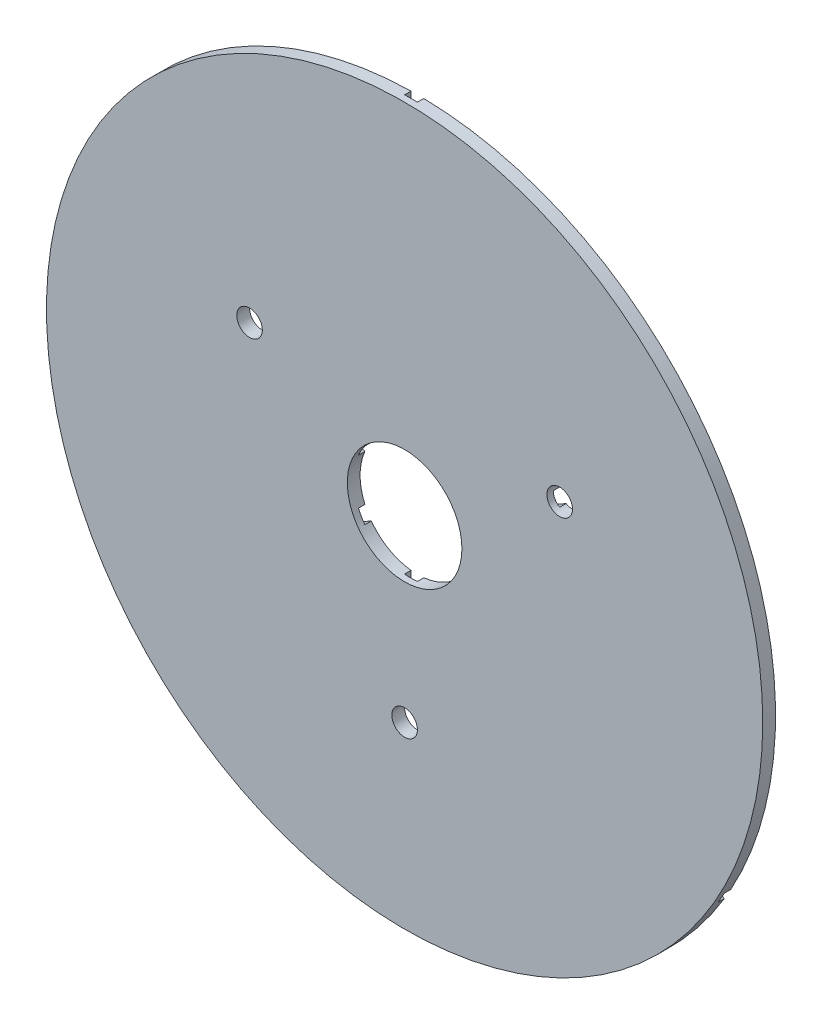
ISO-10303-21;
HEADER;
FILE_DESCRIPTION(('STEP AP214'),'2;1');
FILE_NAME('part.step','',(''),(''),'','','');
FILE_SCHEMA(('AUTOMOTIVE_DESIGN { 1 0 10303 214 1 1 1 1 }'));
ENDSEC;
DATA;
#1=APPLICATION_CONTEXT('core data for automotive mechanical design processes');
#2=APPLICATION_PROTOCOL_DEFINITION('international standard','automotive_design',2000,#1);
#3=PRODUCT_CONTEXT('',#1,'mechanical');
#4=PRODUCT('Part','Part','',(#3));
#5=PRODUCT_RELATED_PRODUCT_CATEGORY('part','',(#4));
#6=PRODUCT_DEFINITION_FORMATION('','',#4);
#7=PRODUCT_DEFINITION_CONTEXT('part definition',#1,'design');
#8=PRODUCT_DEFINITION('design','',#6,#7);
#9=PRODUCT_DEFINITION_SHAPE('','',#8);
#10=(LENGTH_UNIT() NAMED_UNIT(*) SI_UNIT(.MILLI.,.METRE.));
#11=(NAMED_UNIT(*) PLANE_ANGLE_UNIT() SI_UNIT($,.RADIAN.));
#12=(NAMED_UNIT(*) SI_UNIT($,.STERADIAN.) SOLID_ANGLE_UNIT());
#13=UNCERTAINTY_MEASURE_WITH_UNIT(LENGTH_MEASURE(1.E-05),#10,'distance_accuracy_value','');
#14=(GEOMETRIC_REPRESENTATION_CONTEXT(3) GLOBAL_UNCERTAINTY_ASSIGNED_CONTEXT((#13)) GLOBAL_UNIT_ASSIGNED_CONTEXT((#10,
#11,#12)) REPRESENTATION_CONTEXT('',''));
#15=CARTESIAN_POINT('',(0.,0.,0.));
#16=DIRECTION('',(0.,0.,1.));
#17=DIRECTION('',(1.,0.,0.));
#18=AXIS2_PLACEMENT_3D('',#15,#16,#17);
#19=CARTESIAN_POINT('',(0.,0.,1.5875));
#20=DIRECTION('',(0.,0.,-1.));
#21=DIRECTION('',(-1.,0.,0.));
#22=AXIS2_PLACEMENT_3D('',#19,#20,#21);
#23=PLANE('',#22);
#24=CARTESIAN_POINT('',(0.,0.,1.5875));
#25=DIRECTION('',(0.,0.,-1.));
#26=DIRECTION('',(-1.,0.,0.));
#27=AXIS2_PLACEMENT_3D('',#24,#25,#26);
#28=CIRCLE('',#27,14.224);
#29=CARTESIAN_POINT('',(-13.0351353306108,5.692751787375,1.5875));
#30=VERTEX_POINT('',#29);
#31=CARTESIAN_POINT('',(-11.4476353306107,8.44238244439053,1.5875));
#32=VERTEX_POINT('',#31);
#33=EDGE_CURVE('E11',#30,#32,#28,.T.);
#34=ORIENTED_EDGE('',*,*,#33,.F.);
#35=DIRECTION('',(-0.866025403784436,0.500000000000005,0.));
#36=VECTOR('',#35,1.);
#37=CARTESIAN_POINT('',(-0.793749999999747,-1.37481532850734,1.5875));
#38=LINE('',#37,#36);
#39=CARTESIAN_POINT('',(-36.9073291982175,19.4753693429848,1.5875));
#40=VERTEX_POINT('',#39);
#41=EDGE_CURVE('E140',#30,#40,#38,.T.);
#42=ORIENTED_EDGE('',*,*,#41,.T.);
#43=CARTESIAN_POINT('',(-38.4948291982183,22.225,1.5875));
#44=DIRECTION('',(0.,0.,-1.));
#45=DIRECTION('',(-1.,0.,0.));
#46=AXIS2_PLACEMENT_3D('',#43,#44,#45);
#47=CIRCLE('',#46,3.175);
#48=CARTESIAN_POINT('',(-35.3198291982183,22.2250000000009,1.5875));
#49=VERTEX_POINT('',#48);
#50=EDGE_CURVE('E58',#49,#40,#47,.T.);
#51=ORIENTED_EDGE('',*,*,#50,.F.);
#52=DIRECTION('',(-0.866025403784436,0.500000000000005,0.));
#53=VECTOR('',#52,1.);
#54=CARTESIAN_POINT('',(0.793750000000271,1.37481532850825,1.5875));
#55=LINE('',#54,#53);
#56=EDGE_CURVE('E179',#32,#49,#55,.T.);
#57=ORIENTED_EDGE('',*,*,#56,.F.);
#58=EDGE_LOOP('',(#34,#42,#51,#57));
#59=FACE_BOUND('',#58,.T.);
#60=ADVANCED_FACE('F33',(#59),#23,.T.);
#61=CARTESIAN_POINT('',(-1.5875,14.1351342317645,1.5875));
#62=VERTEX_POINT('',#61);
#63=CARTESIAN_POINT('',(1.5875,14.1351342317645,1.5875));
#64=VERTEX_POINT('',#63);
#65=EDGE_CURVE('E42',#62,#64,#28,.T.);
#66=ORIENTED_EDGE('',*,*,#65,.F.);
#67=DIRECTION('',(0.,1.,0.));
#68=VECTOR('',#67,1.);
#69=CARTESIAN_POINT('',(-1.5875,0.,1.5875));
#70=LINE('',#69,#68);
#71=CARTESIAN_POINT('',(-1.5875,88.8858247627258,1.5875));
#72=VERTEX_POINT('',#71);
#73=EDGE_CURVE('E95',#62,#72,#70,.T.);
#74=ORIENTED_EDGE('',*,*,#73,.T.);
#75=CARTESIAN_POINT('',(0.,0.,1.5875));
#76=DIRECTION('',(0.,0.,-1.));
#77=DIRECTION('',(-1.,0.,0.));
#78=AXIS2_PLACEMENT_3D('',#75,#76,#77);
#79=CIRCLE('',#78,88.9);
#80=CARTESIAN_POINT('',(1.5875,88.8858247627258,1.5875));
#81=VERTEX_POINT('',#80);
#82=EDGE_CURVE('E295',#72,#81,#79,.T.);
#83=ORIENTED_EDGE('',*,*,#82,.T.);
#84=DIRECTION('',(0.,1.,0.));
#85=VECTOR('',#84,1.);
#86=CARTESIAN_POINT('',(1.5875,0.,1.5875));
#87=LINE('',#86,#85);
#88=EDGE_CURVE('E300',#64,#81,#87,.T.);
#89=ORIENTED_EDGE('',*,*,#88,.F.);
#90=EDGE_LOOP('',(#66,#74,#83,#89));
#91=FACE_BOUND('',#90,.T.);
#92=ADVANCED_FACE('F448',(#91),#23,.T.);
#93=CARTESIAN_POINT('',(11.4476353306107,8.44238244439054,1.5875));
#94=VERTEX_POINT('',#93);
#95=CARTESIAN_POINT('',(13.0351353306108,5.69275178737501,1.5875));
#96=VERTEX_POINT('',#95);
#97=EDGE_CURVE('E478',#94,#96,#28,.T.);
#98=ORIENTED_EDGE('',*,*,#97,.F.);
#99=DIRECTION('',(0.866025403784436,0.500000000000005,0.));
#100=VECTOR('',#99,1.);
#101=CARTESIAN_POINT('',(-0.793750000000274,1.37481532850825,1.5875));
#102=LINE('',#101,#100);
#103=CARTESIAN_POINT('',(35.3198291982183,22.2250000000009,1.5875));
#104=VERTEX_POINT('',#103);
#105=EDGE_CURVE('E302',#94,#104,#102,.T.);
#106=ORIENTED_EDGE('',*,*,#105,.T.);
#107=CARTESIAN_POINT('',(38.4948291982183,22.225,1.5875));
#108=DIRECTION('',(0.,0.,-1.));
#109=DIRECTION('',(-1.,0.,0.));
#110=AXIS2_PLACEMENT_3D('',#107,#108,#109);
#111=CIRCLE('',#110,3.175);
#112=CARTESIAN_POINT('',(36.9073291982175,19.4753693429848,1.5875));
#113=VERTEX_POINT('',#112);
#114=EDGE_CURVE('E305',#113,#104,#111,.T.);
#115=ORIENTED_EDGE('',*,*,#114,.F.);
#116=DIRECTION('',(0.866025403784436,0.500000000000005,0.));
#117=VECTOR('',#116,1.);
#118=CARTESIAN_POINT('',(0.793749999999744,-1.37481532850733,1.5875));
#119=LINE('',#118,#117);
#120=EDGE_CURVE('E307',#96,#113,#119,.T.);
#121=ORIENTED_EDGE('',*,*,#120,.F.);
#122=EDGE_LOOP('',(#98,#106,#115,#121));
#123=FACE_BOUND('',#122,.T.);
#124=ADVANCED_FACE('F453',(#123),#23,.T.);
#125=CARTESIAN_POINT('',(13.0351353306113,-5.69275178737403,1.5875));
#126=VERTEX_POINT('',#125);
#127=CARTESIAN_POINT('',(11.4476353306113,-8.44238244438968,1.5875));
#128=VERTEX_POINT('',#127);
#129=EDGE_CURVE('E476',#126,#128,#28,.T.);
#130=ORIENTED_EDGE('',*,*,#129,.F.);
#131=DIRECTION('',(-0.866025403784436,0.500000000000005,0.));
#132=VECTOR('',#131,1.);
#133=CARTESIAN_POINT('',(0.793750000000271,1.37481532850825,1.5875));
#134=LINE('',#133,#132);
#135=CARTESIAN_POINT('',(77.7711322808525,-43.0680970528551,1.5875));
#136=VERTEX_POINT('',#135);
#137=EDGE_CURVE('E310',#136,#126,#134,.T.);
#138=ORIENTED_EDGE('',*,*,#137,.F.);
#139=CARTESIAN_POINT('',(0.,0.,1.5875));
#140=DIRECTION('',(0.,0.,-1.));
#141=DIRECTION('',(-1.,0.,0.));
#142=AXIS2_PLACEMENT_3D('',#139,#140,#141);
#143=CIRCLE('',#142,88.9);
#144=CARTESIAN_POINT('',(76.1836322808525,-45.8177277098707,1.5875));
#145=VERTEX_POINT('',#144);
#146=EDGE_CURVE('E313',#136,#145,#143,.T.);
#147=ORIENTED_EDGE('',*,*,#146,.T.);
#148=DIRECTION('',(-0.866025403784436,0.500000000000005,0.));
#149=VECTOR('',#148,1.);
#150=CARTESIAN_POINT('',(-0.793749999999747,-1.37481532850734,1.5875));
#151=LINE('',#150,#149);
#152=EDGE_CURVE('E316',#145,#128,#151,.T.);
#153=ORIENTED_EDGE('',*,*,#152,.T.);
#154=EDGE_LOOP('',(#130,#138,#147,#153));
#155=FACE_BOUND('',#154,.T.);
#156=ADVANCED_FACE('F462',(#155),#23,.T.);
#157=CARTESIAN_POINT('',(1.5875,-14.1351342317645,1.5875));
#158=VERTEX_POINT('',#157);
#159=CARTESIAN_POINT('',(-1.5875,-14.1351342317645,1.5875));
#160=VERTEX_POINT('',#159);
#161=EDGE_CURVE('E330',#158,#160,#28,.T.);
#162=ORIENTED_EDGE('',*,*,#161,.F.);
#163=DIRECTION('',(0.,1.,0.));
#164=VECTOR('',#163,1.);
#165=CARTESIAN_POINT('',(1.5875,0.,1.5875));
#166=LINE('',#165,#164);
#167=CARTESIAN_POINT('',(1.5875,-41.7003693429844,1.5875));
#168=VERTEX_POINT('',#167);
#169=EDGE_CURVE('E319',#168,#158,#166,.T.);
#170=ORIENTED_EDGE('',*,*,#169,.F.);
#171=CARTESIAN_POINT('',(0.,-44.45,1.5875));
#172=DIRECTION('',(0.,0.,-1.));
#173=DIRECTION('',(-1.,0.,0.));
#174=AXIS2_PLACEMENT_3D('',#171,#172,#173);
#175=CIRCLE('',#174,3.175);
#176=CARTESIAN_POINT('',(-1.5875,-41.7003693429844,1.5875));
#177=VERTEX_POINT('',#176);
#178=EDGE_CURVE('E322',#177,#168,#175,.T.);
#179=ORIENTED_EDGE('',*,*,#178,.F.);
#180=DIRECTION('',(0.,1.,0.));
#181=VECTOR('',#180,1.);
#182=CARTESIAN_POINT('',(-1.5875,0.,1.5875));
#183=LINE('',#182,#181);
#184=EDGE_CURVE('E134',#177,#160,#183,.T.);
#185=ORIENTED_EDGE('',*,*,#184,.T.);
#186=EDGE_LOOP('',(#162,#170,#179,#185));
#187=FACE_BOUND('',#186,.T.);
#188=ADVANCED_FACE('F328',(#187),#23,.T.);
#189=CARTESIAN_POINT('',(0.,0.,3.175));
#190=DIRECTION('',(0.,0.,-1.));
#191=DIRECTION('',(-1.,0.,0.));
#192=AXIS2_PLACEMENT_3D('',#189,#190,#191);
#193=CYLINDRICAL_SURFACE('',#192,88.9);
#194=CARTESIAN_POINT('',(0.,0.,3.175));
#195=DIRECTION('',(0.,0.,1.));
#196=DIRECTION('',(1.,0.,0.));
#197=AXIS2_PLACEMENT_3D('',#194,#195,#196);
#198=CIRCLE('',#197,88.9);
#199=CARTESIAN_POINT('',(88.9,0.,3.175));
#200=VERTEX_POINT('',#199);
#201=EDGE_CURVE('E208',#200,#200,#198,.T.);
#202=ORIENTED_EDGE('',*,*,#201,.F.);
#203=EDGE_LOOP('',(#202));
#204=FACE_BOUND('',#203,.T.);
#205=DIRECTION('',(0.,0.,-1.));
#206=VECTOR('',#205,1.);
#207=CARTESIAN_POINT('',(1.5875,88.8858247627258,1.5875));
#208=LINE('',#207,#206);
#209=CARTESIAN_POINT('',(1.5875,88.8858247627258,0.));
#210=VERTEX_POINT('',#209);
#211=EDGE_CURVE('E203',#81,#210,#208,.T.);
#212=ORIENTED_EDGE('',*,*,#211,.F.);
#213=ORIENTED_EDGE('',*,*,#82,.F.);
#214=DIRECTION('',(0.,0.,-1.));
#215=VECTOR('',#214,1.);
#216=CARTESIAN_POINT('',(-1.5875,88.8858247627258,1.5875));
#217=LINE('',#216,#215);
#218=CARTESIAN_POINT('',(-1.5875,88.8858247627258,0.));
#219=VERTEX_POINT('',#218);
#220=EDGE_CURVE('E146',#72,#219,#217,.T.);
#221=ORIENTED_EDGE('',*,*,#220,.T.);
#222=CARTESIAN_POINT('',(0.,0.,0.));
#223=DIRECTION('',(0.,0.,1.));
#224=DIRECTION('',(1.,0.,0.));
#225=AXIS2_PLACEMENT_3D('',#222,#223,#224);
#226=CIRCLE('',#225,88.9);
#227=CARTESIAN_POINT('',(-77.7711322808525,-43.0680970528551,0.));
#228=VERTEX_POINT('',#227);
#229=EDGE_CURVE('E210',#219,#228,#226,.T.);
#230=ORIENTED_EDGE('',*,*,#229,.T.);
#231=DIRECTION('',(0.,0.,-1.));
#232=VECTOR('',#231,1.);
#233=CARTESIAN_POINT('',(-77.7711322808525,-43.0680970528551,1.5875));
#234=LINE('',#233,#232);
#235=CARTESIAN_POINT('',(-77.7711322808525,-43.0680970528551,1.5875));
#236=VERTEX_POINT('',#235);
#237=EDGE_CURVE('E86',#236,#228,#234,.T.);
#238=ORIENTED_EDGE('',*,*,#237,.F.);
#239=CARTESIAN_POINT('',(0.,0.,1.5875));
#240=DIRECTION('',(0.,0.,-1.));
#241=DIRECTION('',(-1.,0.,0.));
#242=AXIS2_PLACEMENT_3D('',#239,#240,#241);
#243=CIRCLE('',#242,88.9);
#244=CARTESIAN_POINT('',(-76.1836322808525,-45.8177277098707,1.5875));
#245=VERTEX_POINT('',#244);
#246=EDGE_CURVE('E133',#245,#236,#243,.T.);
#247=ORIENTED_EDGE('',*,*,#246,.F.);
#248=DIRECTION('',(0.,0.,-1.));
#249=VECTOR('',#248,1.);
#250=CARTESIAN_POINT('',(-76.1836322808525,-45.8177277098707,1.5875));
#251=LINE('',#250,#249);
#252=CARTESIAN_POINT('',(-76.1836322808525,-45.8177277098707,0.));
#253=VERTEX_POINT('',#252);
#254=EDGE_CURVE('E117',#245,#253,#251,.T.);
#255=ORIENTED_EDGE('',*,*,#254,.T.);
#256=CARTESIAN_POINT('',(76.1836322808525,-45.8177277098707,0.));
#257=VERTEX_POINT('',#256);
#258=EDGE_CURVE('E212',#253,#257,#226,.T.);
#259=ORIENTED_EDGE('',*,*,#258,.T.);
#260=DIRECTION('',(0.,0.,-1.));
#261=VECTOR('',#260,1.);
#262=CARTESIAN_POINT('',(76.1836322808525,-45.8177277098707,1.5875));
#263=LINE('',#262,#261);
#264=EDGE_CURVE('E192',#145,#257,#263,.T.);
#265=ORIENTED_EDGE('',*,*,#264,.F.);
#266=ORIENTED_EDGE('',*,*,#146,.F.);
#267=DIRECTION('',(0.,0.,-1.));
#268=VECTOR('',#267,1.);
#269=CARTESIAN_POINT('',(77.7711322808525,-43.0680970528551,1.5875));
#270=LINE('',#269,#268);
#271=CARTESIAN_POINT('',(77.7711322808525,-43.0680970528551,0.));
#272=VERTEX_POINT('',#271);
#273=EDGE_CURVE('E194',#136,#272,#270,.T.);
#274=ORIENTED_EDGE('',*,*,#273,.T.);
#275=EDGE_CURVE('E183',#272,#210,#226,.T.);
#276=ORIENTED_EDGE('',*,*,#275,.T.);
#277=EDGE_LOOP('',(#212,#213,#221,#230,#238,#247,#255,#259,#265,#266,#274,#276));
#278=FACE_BOUND('',#277,.T.);
#279=ADVANCED_FACE('F35',(#204,#278),#193,.T.);
#280=CARTESIAN_POINT('',(0.,0.,0.));
#281=DIRECTION('',(0.,0.,1.));
#282=DIRECTION('',(1.,0.,0.));
#283=AXIS2_PLACEMENT_3D('',#280,#281,#282);
#284=PLANE('',#283);
#285=DIRECTION('',(0.,1.,0.));
#286=VECTOR('',#285,1.);
#287=CARTESIAN_POINT('',(-1.5875,0.,0.));
#288=LINE('',#287,#286);
#289=CARTESIAN_POINT('',(-1.5875,-41.7003693429844,0.));
#290=VERTEX_POINT('',#289);
#291=CARTESIAN_POINT('',(-1.5875,-14.1351342317645,0.));
#292=VERTEX_POINT('',#291);
#293=EDGE_CURVE('E170',#290,#292,#288,.T.);
#294=ORIENTED_EDGE('',*,*,#293,.F.);
#295=CARTESIAN_POINT('',(0.,-44.45,0.));
#296=DIRECTION('',(0.,0.,-1.));
#297=DIRECTION('',(-1.,0.,0.));
#298=AXIS2_PLACEMENT_3D('',#295,#296,#297);
#299=CIRCLE('',#298,3.175);
#300=CARTESIAN_POINT('',(1.5875,-41.7003693429844,0.));
#301=VERTEX_POINT('',#300);
#302=EDGE_CURVE('E387',#301,#290,#299,.T.);
#303=ORIENTED_EDGE('',*,*,#302,.F.);
#304=DIRECTION('',(0.,1.,0.));
#305=VECTOR('',#304,1.);
#306=CARTESIAN_POINT('',(1.5875,0.,0.));
#307=LINE('',#306,#305);
#308=CARTESIAN_POINT('',(1.5875,-14.1351342317645,0.));
#309=VERTEX_POINT('',#308);
#310=EDGE_CURVE('E167',#301,#309,#307,.T.);
#311=ORIENTED_EDGE('',*,*,#310,.T.);
#312=CARTESIAN_POINT('',(0.,0.,0.));
#313=DIRECTION('',(0.,0.,1.));
#314=DIRECTION('',(1.,0.,0.));
#315=AXIS2_PLACEMENT_3D('',#312,#313,#314);
#316=CIRCLE('',#315,14.224);
#317=CARTESIAN_POINT('',(11.4476353306113,-8.44238244438968,0.));
#318=VERTEX_POINT('',#317);
#319=EDGE_CURVE('E394',#309,#318,#316,.T.);
#320=ORIENTED_EDGE('',*,*,#319,.T.);
#321=DIRECTION('',(-0.866025403784436,0.500000000000005,0.));
#322=VECTOR('',#321,1.);
#323=CARTESIAN_POINT('',(-0.793749999999747,-1.37481532850734,0.));
#324=LINE('',#323,#322);
#325=EDGE_CURVE('E164',#257,#318,#324,.T.);
#326=ORIENTED_EDGE('',*,*,#325,.F.);
#327=ORIENTED_EDGE('',*,*,#258,.F.);
#328=DIRECTION('',(0.866025403784436,0.500000000000005,0.));
#329=VECTOR('',#328,1.);
#330=CARTESIAN_POINT('',(0.793749999999744,-1.37481532850733,0.));
#331=LINE('',#330,#329);
#332=CARTESIAN_POINT('',(-11.4476353306113,-8.44238244438967,0.));
#333=VERTEX_POINT('',#332);
#334=EDGE_CURVE('E122',#253,#333,#331,.T.);
#335=ORIENTED_EDGE('',*,*,#334,.T.);
#336=EDGE_CURVE('E504',#333,#292,#316,.T.);
#337=ORIENTED_EDGE('',*,*,#336,.T.);
#338=EDGE_LOOP('',(#294,#303,#311,#320,#326,#327,#335,#337));
#339=FACE_BOUND('',#338,.T.);
#340=ADVANCED_FACE('F467',(#339),#284,.F.);
#341=DIRECTION('',(0.866025403784436,0.500000000000005,0.));
#342=VECTOR('',#341,1.);
#343=CARTESIAN_POINT('',(0.793749999999744,-1.37481532850733,0.));
#344=LINE('',#343,#342);
#345=CARTESIAN_POINT('',(13.0351353306108,5.69275178737501,0.));
#346=VERTEX_POINT('',#345);
#347=CARTESIAN_POINT('',(36.9073291982175,19.4753693429848,0.));
#348=VERTEX_POINT('',#347);
#349=EDGE_CURVE('E158',#346,#348,#344,.T.);
#350=ORIENTED_EDGE('',*,*,#349,.T.);
#351=CARTESIAN_POINT('',(38.4948291982183,22.225,0.));
#352=DIRECTION('',(0.,0.,-1.));
#353=DIRECTION('',(-1.,0.,0.));
#354=AXIS2_PLACEMENT_3D('',#351,#352,#353);
#355=CIRCLE('',#354,3.175);
#356=CARTESIAN_POINT('',(35.3198291982183,22.225,0.));
#357=VERTEX_POINT('',#356);
#358=EDGE_CURVE('E384',#357,#348,#355,.T.);
#359=ORIENTED_EDGE('',*,*,#358,.F.);
#360=DIRECTION('',(0.866025403784436,0.500000000000005,0.));
#361=VECTOR('',#360,1.);
#362=CARTESIAN_POINT('',(-0.793750000000274,1.37481532850825,0.));
#363=LINE('',#362,#361);
#364=CARTESIAN_POINT('',(11.4476353306107,8.44238244439053,0.));
#365=VERTEX_POINT('',#364);
#366=EDGE_CURVE('E155',#365,#357,#363,.T.);
#367=ORIENTED_EDGE('',*,*,#366,.F.);
#368=CARTESIAN_POINT('',(1.5875,14.1351342317645,0.));
#369=VERTEX_POINT('',#368);
#370=EDGE_CURVE('E364',#365,#369,#316,.T.);
#371=ORIENTED_EDGE('',*,*,#370,.T.);
#372=DIRECTION('',(0.,1.,0.));
#373=VECTOR('',#372,1.);
#374=CARTESIAN_POINT('',(1.5875,0.,0.));
#375=LINE('',#374,#373);
#376=EDGE_CURVE('E153',#369,#210,#375,.T.);
#377=ORIENTED_EDGE('',*,*,#376,.T.);
#378=ORIENTED_EDGE('',*,*,#275,.F.);
#379=DIRECTION('',(-0.866025403784436,0.500000000000005,0.));
#380=VECTOR('',#379,1.);
#381=CARTESIAN_POINT('',(0.793750000000271,1.37481532850825,0.));
#382=LINE('',#381,#380);
#383=CARTESIAN_POINT('',(13.0351353306113,-5.69275178737403,0.));
#384=VERTEX_POINT('',#383);
#385=EDGE_CURVE('E161',#272,#384,#382,.T.);
#386=ORIENTED_EDGE('',*,*,#385,.T.);
#387=EDGE_CURVE('E391',#384,#346,#316,.T.);
#388=ORIENTED_EDGE('',*,*,#387,.T.);
#389=EDGE_LOOP('',(#350,#359,#367,#371,#377,#378,#386,#388));
#390=FACE_BOUND('',#389,.T.);
#391=ADVANCED_FACE('F419',(#390),#284,.F.);
#392=CARTESIAN_POINT('',(0.,0.,3.175));
#393=DIRECTION('',(0.,0.,1.));
#394=DIRECTION('',(1.,0.,0.));
#395=AXIS2_PLACEMENT_3D('',#392,#393,#394);
#396=PLANE('',#395);
#397=CARTESIAN_POINT('',(38.4948291982183,22.225,3.175));
#398=DIRECTION('',(0.,0.,-1.));
#399=DIRECTION('',(-1.,0.,0.));
#400=AXIS2_PLACEMENT_3D('',#397,#398,#399);
#401=CIRCLE('',#400,3.175);
#402=CARTESIAN_POINT('',(35.3198291982183,22.225,3.175));
#403=VERTEX_POINT('',#402);
#404=EDGE_CURVE('E398',#403,#403,#401,.T.);
#405=ORIENTED_EDGE('',*,*,#404,.T.);
#406=EDGE_LOOP('',(#405));
#407=FACE_BOUND('',#406,.T.);
#408=CARTESIAN_POINT('',(-38.4948291982183,22.225,3.175));
#409=DIRECTION('',(0.,0.,-1.));
#410=DIRECTION('',(-1.,0.,0.));
#411=AXIS2_PLACEMENT_3D('',#408,#409,#410);
#412=CIRCLE('',#411,3.175);
#413=CARTESIAN_POINT('',(-41.6698291982183,22.225,3.175));
#414=VERTEX_POINT('',#413);
#415=EDGE_CURVE('E380',#414,#414,#412,.T.);
#416=ORIENTED_EDGE('',*,*,#415,.T.);
#417=EDGE_LOOP('',(#416));
#418=FACE_BOUND('',#417,.T.);
#419=CARTESIAN_POINT('',(0.,-44.45,3.175));
#420=DIRECTION('',(0.,0.,-1.));
#421=DIRECTION('',(-1.,0.,0.));
#422=AXIS2_PLACEMENT_3D('',#419,#420,#421);
#423=CIRCLE('',#422,3.175);
#424=CARTESIAN_POINT('',(-3.175,-44.45,3.175));
#425=VERTEX_POINT('',#424);
#426=EDGE_CURVE('E381',#425,#425,#423,.T.);
#427=ORIENTED_EDGE('',*,*,#426,.T.);
#428=EDGE_LOOP('',(#427));
#429=FACE_BOUND('',#428,.T.);
#430=CARTESIAN_POINT('',(0.,0.,3.175));
#431=DIRECTION('',(0.,0.,1.));
#432=DIRECTION('',(1.,0.,0.));
#433=AXIS2_PLACEMENT_3D('',#430,#431,#432);
#434=CIRCLE('',#433,14.224);
#435=CARTESIAN_POINT('',(14.224,0.,3.175));
#436=VERTEX_POINT('',#435);
#437=EDGE_CURVE('E395',#436,#436,#434,.T.);
#438=ORIENTED_EDGE('',*,*,#437,.F.);
#439=EDGE_LOOP('',(#438));
#440=FACE_BOUND('',#439,.T.);
#441=ORIENTED_EDGE('',*,*,#201,.T.);
#442=EDGE_LOOP('',(#441));
#443=FACE_BOUND('',#442,.T.);
#444=ADVANCED_FACE('F431',(#407,#418,#429,#440,#443),#396,.T.);
#445=DIRECTION('',(-0.866025403784436,0.500000000000005,0.));
#446=VECTOR('',#445,1.);
#447=CARTESIAN_POINT('',(0.793750000000271,1.37481532850825,0.));
#448=LINE('',#447,#446);
#449=CARTESIAN_POINT('',(-11.4476353306107,8.44238244439053,0.));
#450=VERTEX_POINT('',#449);
#451=CARTESIAN_POINT('',(-35.3198291982183,22.2250000000009,0.));
#452=VERTEX_POINT('',#451);
#453=EDGE_CURVE('E147',#450,#452,#448,.T.);
#454=ORIENTED_EDGE('',*,*,#453,.T.);
#455=CARTESIAN_POINT('',(-38.4948291982183,22.225,0.));
#456=DIRECTION('',(0.,0.,-1.));
#457=DIRECTION('',(-1.,0.,0.));
#458=AXIS2_PLACEMENT_3D('',#455,#456,#457);
#459=CIRCLE('',#458,3.175);
#460=CARTESIAN_POINT('',(-36.9073291982175,19.4753693429848,0.));
#461=VERTEX_POINT('',#460);
#462=EDGE_CURVE('E379',#461,#452,#459,.T.);
#463=ORIENTED_EDGE('',*,*,#462,.F.);
#464=DIRECTION('',(-0.866025403784436,0.500000000000005,0.));
#465=VECTOR('',#464,1.);
#466=CARTESIAN_POINT('',(-0.793749999999747,-1.37481532850734,0.));
#467=LINE('',#466,#465);
#468=CARTESIAN_POINT('',(-13.0351353306108,5.692751787375,0.));
#469=VERTEX_POINT('',#468);
#470=EDGE_CURVE('E176',#469,#461,#467,.T.);
#471=ORIENTED_EDGE('',*,*,#470,.F.);
#472=CARTESIAN_POINT('',(-13.0351353306113,-5.69275178737403,0.));
#473=VERTEX_POINT('',#472);
#474=EDGE_CURVE('E225',#469,#473,#316,.T.);
#475=ORIENTED_EDGE('',*,*,#474,.T.);
#476=DIRECTION('',(0.866025403784436,0.500000000000005,0.));
#477=VECTOR('',#476,1.);
#478=CARTESIAN_POINT('',(-0.793750000000274,1.37481532850825,0.));
#479=LINE('',#478,#477);
#480=EDGE_CURVE('E174',#228,#473,#479,.T.);
#481=ORIENTED_EDGE('',*,*,#480,.F.);
#482=ORIENTED_EDGE('',*,*,#229,.F.);
#483=DIRECTION('',(0.,1.,0.));
#484=VECTOR('',#483,1.);
#485=CARTESIAN_POINT('',(-1.5875,0.,0.));
#486=LINE('',#485,#484);
#487=CARTESIAN_POINT('',(-1.5875,14.1351342317645,0.));
#488=VERTEX_POINT('',#487);
#489=EDGE_CURVE('E150',#488,#219,#486,.T.);
#490=ORIENTED_EDGE('',*,*,#489,.F.);
#491=EDGE_CURVE('E361',#488,#450,#316,.T.);
#492=ORIENTED_EDGE('',*,*,#491,.T.);
#493=EDGE_LOOP('',(#454,#463,#471,#475,#481,#482,#490,#492));
#494=FACE_BOUND('',#493,.T.);
#495=ADVANCED_FACE('F218',(#494),#284,.F.);
#496=CARTESIAN_POINT('',(0.793750000000271,1.37481532850825,1.5875));
#497=DIRECTION('',(-0.500000000000005,-0.866025403784436,0.));
#498=DIRECTION('',(0.866025403784436,-0.500000000000005,0.));
#499=AXIS2_PLACEMENT_3D('',#496,#497,#498);
#500=PLANE('',#499);
#501=DIRECTION('',(0.,0.,1.));
#502=VECTOR('',#501,1.);
#503=CARTESIAN_POINT('',(-11.4476353306107,8.44238244439053,0.));
#504=LINE('',#503,#502);
#505=EDGE_CURVE('E151',#32,#450,#504,.F.);
#506=ORIENTED_EDGE('',*,*,#505,.F.);
#507=ORIENTED_EDGE('',*,*,#56,.T.);
#508=DIRECTION('',(0.,0.,-1.));
#509=VECTOR('',#508,1.);
#510=CARTESIAN_POINT('',(-35.3198291982183,22.2250000000009,1.5875));
#511=LINE('',#510,#509);
#512=EDGE_CURVE('E180',#49,#452,#511,.T.);
#513=ORIENTED_EDGE('',*,*,#512,.T.);
#514=ORIENTED_EDGE('',*,*,#453,.F.);
#515=EDGE_LOOP('',(#506,#507,#513,#514));
#516=FACE_BOUND('',#515,.T.);
#517=ADVANCED_FACE('F291',(#516),#500,.T.);
#518=CARTESIAN_POINT('',(-0.793749999999747,-1.37481532850734,1.5875));
#519=DIRECTION('',(-0.500000000000005,-0.866025403784436,0.));
#520=DIRECTION('',(0.866025403784436,-0.500000000000005,0.));
#521=AXIS2_PLACEMENT_3D('',#518,#519,#520);
#522=PLANE('',#521);
#523=ORIENTED_EDGE('',*,*,#41,.F.);
#524=DIRECTION('',(0.,0.,1.));
#525=VECTOR('',#524,1.);
#526=CARTESIAN_POINT('',(-13.0351353306108,5.692751787375,0.));
#527=LINE('',#526,#525);
#528=EDGE_CURVE('E278',#30,#469,#527,.F.);
#529=ORIENTED_EDGE('',*,*,#528,.T.);
#530=ORIENTED_EDGE('',*,*,#470,.T.);
#531=DIRECTION('',(0.,0.,-1.));
#532=VECTOR('',#531,1.);
#533=CARTESIAN_POINT('',(-36.9073291982175,19.4753693429848,1.5875));
#534=LINE('',#533,#532);
#535=EDGE_CURVE('E184',#40,#461,#534,.T.);
#536=ORIENTED_EDGE('',*,*,#535,.F.);
#537=EDGE_LOOP('',(#523,#529,#530,#536));
#538=FACE_BOUND('',#537,.T.);
#539=ADVANCED_FACE('F376',(#538),#522,.F.);
#540=CARTESIAN_POINT('',(-0.793750000000274,1.37481532850825,1.5875));
#541=DIRECTION('',(-0.500000000000005,0.866025403784436,0.));
#542=DIRECTION('',(-0.866025403784436,-0.500000000000005,0.));
#543=AXIS2_PLACEMENT_3D('',#540,#541,#542);
#544=PLANE('',#543);
#545=ORIENTED_EDGE('',*,*,#480,.T.);
#546=DIRECTION('',(0.,0.,1.));
#547=VECTOR('',#546,1.);
#548=CARTESIAN_POINT('',(-13.0351353306113,-5.69275178737403,0.));
#549=LINE('',#548,#547);
#550=CARTESIAN_POINT('',(-13.0351353306113,-5.69275178737403,1.5875));
#551=VERTEX_POINT('',#550);
#552=EDGE_CURVE('E230',#473,#551,#549,.T.);
#553=ORIENTED_EDGE('',*,*,#552,.T.);
#554=DIRECTION('',(0.866025403784436,0.500000000000005,0.));
#555=VECTOR('',#554,1.);
#556=CARTESIAN_POINT('',(-0.793750000000274,1.37481532850825,1.5875));
#557=LINE('',#556,#555);
#558=EDGE_CURVE('E138',#236,#551,#557,.T.);
#559=ORIENTED_EDGE('',*,*,#558,.F.);
#560=ORIENTED_EDGE('',*,*,#237,.T.);
#561=EDGE_LOOP('',(#545,#553,#559,#560));
#562=FACE_BOUND('',#561,.T.);
#563=ADVANCED_FACE('F227',(#562),#544,.F.);
#564=CARTESIAN_POINT('',(0.793749999999744,-1.37481532850733,1.5875));
#565=DIRECTION('',(-0.500000000000005,0.866025403784436,0.));
#566=DIRECTION('',(-0.866025403784436,-0.500000000000005,0.));
#567=AXIS2_PLACEMENT_3D('',#564,#565,#566);
#568=PLANE('',#567);
#569=DIRECTION('',(0.,0.,1.));
#570=VECTOR('',#569,1.);
#571=CARTESIAN_POINT('',(-11.4476353306113,-8.44238244438967,0.));
#572=LINE('',#571,#570);
#573=CARTESIAN_POINT('',(-11.4476353306113,-8.44238244438968,1.5875));
#574=VERTEX_POINT('',#573);
#575=EDGE_CURVE('E49',#333,#574,#572,.T.);
#576=ORIENTED_EDGE('',*,*,#575,.F.);
#577=ORIENTED_EDGE('',*,*,#334,.F.);
#578=ORIENTED_EDGE('',*,*,#254,.F.);
#579=DIRECTION('',(0.866025403784436,0.500000000000005,0.));
#580=VECTOR('',#579,1.);
#581=CARTESIAN_POINT('',(0.793749999999744,-1.37481532850733,1.5875));
#582=LINE('',#581,#580);
#583=EDGE_CURVE('E120',#245,#574,#582,.T.);
#584=ORIENTED_EDGE('',*,*,#583,.T.);
#585=EDGE_LOOP('',(#576,#577,#578,#584));
#586=FACE_BOUND('',#585,.T.);
#587=ADVANCED_FACE('F119',(#586),#568,.T.);
#588=CARTESIAN_POINT('',(-1.5875,0.,1.5875));
#589=DIRECTION('',(-1.,0.,0.));
#590=DIRECTION('',(0.,0.,1.));
#591=AXIS2_PLACEMENT_3D('',#588,#589,#590);
#592=PLANE('',#591);
#593=ORIENTED_EDGE('',*,*,#293,.T.);
#594=DIRECTION('',(0.,0.,1.));
#595=VECTOR('',#594,1.);
#596=CARTESIAN_POINT('',(-1.5875,-14.1351342317645,0.));
#597=LINE('',#596,#595);
#598=EDGE_CURVE('E338',#292,#160,#597,.T.);
#599=ORIENTED_EDGE('',*,*,#598,.T.);
#600=ORIENTED_EDGE('',*,*,#184,.F.);
#601=DIRECTION('',(0.,0.,-1.));
#602=VECTOR('',#601,1.);
#603=CARTESIAN_POINT('',(-1.5875,-41.7003693429844,1.5875));
#604=LINE('',#603,#602);
#605=EDGE_CURVE('E127',#177,#290,#604,.T.);
#606=ORIENTED_EDGE('',*,*,#605,.T.);
#607=EDGE_LOOP('',(#593,#599,#600,#606));
#608=FACE_BOUND('',#607,.T.);
#609=ADVANCED_FACE('F334',(#608),#592,.F.);
#610=CARTESIAN_POINT('',(1.5875,0.,1.5875));
#611=DIRECTION('',(-1.,0.,0.));
#612=DIRECTION('',(0.,0.,1.));
#613=AXIS2_PLACEMENT_3D('',#610,#611,#612);
#614=PLANE('',#613);
#615=DIRECTION('',(0.,0.,1.));
#616=VECTOR('',#615,1.);
#617=CARTESIAN_POINT('',(1.5875,-14.1351342317645,0.));
#618=LINE('',#617,#616);
#619=EDGE_CURVE('E401',#309,#158,#618,.T.);
#620=ORIENTED_EDGE('',*,*,#619,.F.);
#621=ORIENTED_EDGE('',*,*,#310,.F.);
#622=DIRECTION('',(0.,0.,-1.));
#623=VECTOR('',#622,1.);
#624=CARTESIAN_POINT('',(1.5875,-41.7003693429844,1.5875));
#625=LINE('',#624,#623);
#626=EDGE_CURVE('E189',#168,#301,#625,.T.);
#627=ORIENTED_EDGE('',*,*,#626,.F.);
#628=ORIENTED_EDGE('',*,*,#169,.T.);
#629=EDGE_LOOP('',(#620,#621,#627,#628));
#630=FACE_BOUND('',#629,.T.);
#631=ADVANCED_FACE('F502',(#630),#614,.T.);
#632=CARTESIAN_POINT('',(-0.793749999999747,-1.37481532850734,1.5875));
#633=DIRECTION('',(-0.500000000000005,-0.866025403784436,0.));
#634=DIRECTION('',(0.866025403784436,-0.500000000000005,0.));
#635=AXIS2_PLACEMENT_3D('',#632,#633,#634);
#636=PLANE('',#635);
#637=ORIENTED_EDGE('',*,*,#325,.T.);
#638=DIRECTION('',(0.,0.,1.));
#639=VECTOR('',#638,1.);
#640=CARTESIAN_POINT('',(11.4476353306113,-8.44238244438968,0.));
#641=LINE('',#640,#639);
#642=EDGE_CURVE('E406',#318,#128,#641,.T.);
#643=ORIENTED_EDGE('',*,*,#642,.T.);
#644=ORIENTED_EDGE('',*,*,#152,.F.);
#645=ORIENTED_EDGE('',*,*,#264,.T.);
#646=EDGE_LOOP('',(#637,#643,#644,#645));
#647=FACE_BOUND('',#646,.T.);
#648=ADVANCED_FACE('F506',(#647),#636,.F.);
#649=CARTESIAN_POINT('',(0.793750000000271,1.37481532850825,1.5875));
#650=DIRECTION('',(-0.500000000000005,-0.866025403784436,0.));
#651=DIRECTION('',(0.866025403784436,-0.500000000000005,0.));
#652=AXIS2_PLACEMENT_3D('',#649,#650,#651);
#653=PLANE('',#652);
#654=DIRECTION('',(0.,0.,1.));
#655=VECTOR('',#654,1.);
#656=CARTESIAN_POINT('',(13.0351353306113,-5.69275178737403,0.));
#657=LINE('',#656,#655);
#658=EDGE_CURVE('E404',#384,#126,#657,.T.);
#659=ORIENTED_EDGE('',*,*,#658,.F.);
#660=ORIENTED_EDGE('',*,*,#385,.F.);
#661=ORIENTED_EDGE('',*,*,#273,.F.);
#662=ORIENTED_EDGE('',*,*,#137,.T.);
#663=EDGE_LOOP('',(#659,#660,#661,#662));
#664=FACE_BOUND('',#663,.T.);
#665=ADVANCED_FACE('F481',(#664),#653,.T.);
#666=CARTESIAN_POINT('',(0.793749999999744,-1.37481532850733,1.5875));
#667=DIRECTION('',(-0.500000000000005,0.866025403784436,0.));
#668=DIRECTION('',(-0.866025403784436,-0.500000000000005,0.));
#669=AXIS2_PLACEMENT_3D('',#666,#667,#668);
#670=PLANE('',#669);
#671=DIRECTION('',(0.,0.,1.));
#672=VECTOR('',#671,1.);
#673=CARTESIAN_POINT('',(13.0351353306108,5.69275178737501,0.));
#674=LINE('',#673,#672);
#675=EDGE_CURVE('E369',#96,#346,#674,.F.);
#676=ORIENTED_EDGE('',*,*,#675,.F.);
#677=ORIENTED_EDGE('',*,*,#120,.T.);
#678=DIRECTION('',(0.,0.,-1.));
#679=VECTOR('',#678,1.);
#680=CARTESIAN_POINT('',(36.9073291982175,19.4753693429848,1.5875));
#681=LINE('',#680,#679);
#682=EDGE_CURVE('E197',#113,#348,#681,.T.);
#683=ORIENTED_EDGE('',*,*,#682,.T.);
#684=ORIENTED_EDGE('',*,*,#349,.F.);
#685=EDGE_LOOP('',(#676,#677,#683,#684));
#686=FACE_BOUND('',#685,.T.);
#687=ADVANCED_FACE('F489',(#686),#670,.T.);
#688=CARTESIAN_POINT('',(-0.793750000000274,1.37481532850825,1.5875));
#689=DIRECTION('',(-0.500000000000005,0.866025403784436,0.));
#690=DIRECTION('',(-0.866025403784436,-0.500000000000005,0.));
#691=AXIS2_PLACEMENT_3D('',#688,#689,#690);
#692=PLANE('',#691);
#693=ORIENTED_EDGE('',*,*,#105,.F.);
#694=DIRECTION('',(0.,0.,1.));
#695=VECTOR('',#694,1.);
#696=CARTESIAN_POINT('',(11.4476353306107,8.44238244439053,0.));
#697=LINE('',#696,#695);
#698=EDGE_CURVE('E372',#94,#365,#697,.F.);
#699=ORIENTED_EDGE('',*,*,#698,.T.);
#700=ORIENTED_EDGE('',*,*,#366,.T.);
#701=DIRECTION('',(0.,0.,-1.));
#702=VECTOR('',#701,1.);
#703=CARTESIAN_POINT('',(35.3198291982183,22.2250000000009,1.5875));
#704=LINE('',#703,#702);
#705=EDGE_CURVE('E200',#104,#357,#704,.T.);
#706=ORIENTED_EDGE('',*,*,#705,.F.);
#707=EDGE_LOOP('',(#693,#699,#700,#706));
#708=FACE_BOUND('',#707,.T.);
#709=ADVANCED_FACE('F412',(#708),#692,.F.);
#710=CARTESIAN_POINT('',(1.5875,0.,1.5875));
#711=DIRECTION('',(-1.,0.,0.));
#712=DIRECTION('',(0.,0.,1.));
#713=AXIS2_PLACEMENT_3D('',#710,#711,#712);
#714=PLANE('',#713);
#715=DIRECTION('',(0.,0.,1.));
#716=VECTOR('',#715,1.);
#717=CARTESIAN_POINT('',(1.5875,14.1351342317645,0.));
#718=LINE('',#717,#716);
#719=EDGE_CURVE('E368',#64,#369,#718,.F.);
#720=ORIENTED_EDGE('',*,*,#719,.F.);
#721=ORIENTED_EDGE('',*,*,#88,.T.);
#722=ORIENTED_EDGE('',*,*,#211,.T.);
#723=ORIENTED_EDGE('',*,*,#376,.F.);
#724=EDGE_LOOP('',(#720,#721,#722,#723));
#725=FACE_BOUND('',#724,.T.);
#726=ADVANCED_FACE('F459',(#725),#714,.T.);
#727=CARTESIAN_POINT('',(-1.5875,0.,1.5875));
#728=DIRECTION('',(-1.,0.,0.));
#729=DIRECTION('',(0.,0.,1.));
#730=AXIS2_PLACEMENT_3D('',#727,#728,#729);
#731=PLANE('',#730);
#732=ORIENTED_EDGE('',*,*,#73,.F.);
#733=DIRECTION('',(0.,0.,1.));
#734=VECTOR('',#733,1.);
#735=CARTESIAN_POINT('',(-1.5875,14.1351342317645,0.));
#736=LINE('',#735,#734);
#737=EDGE_CURVE('E363',#62,#488,#736,.F.);
#738=ORIENTED_EDGE('',*,*,#737,.T.);
#739=ORIENTED_EDGE('',*,*,#489,.T.);
#740=ORIENTED_EDGE('',*,*,#220,.F.);
#741=EDGE_LOOP('',(#732,#738,#739,#740));
#742=FACE_BOUND('',#741,.T.);
#743=ADVANCED_FACE('F367',(#742),#731,.F.);
#744=EDGE_CURVE('E37',#574,#551,#28,.T.);
#745=ORIENTED_EDGE('',*,*,#744,.F.);
#746=ORIENTED_EDGE('',*,*,#583,.F.);
#747=ORIENTED_EDGE('',*,*,#246,.T.);
#748=ORIENTED_EDGE('',*,*,#558,.T.);
#749=EDGE_LOOP('',(#745,#746,#747,#748));
#750=FACE_BOUND('',#749,.T.);
#751=ADVANCED_FACE('F131',(#750),#23,.T.);
#752=CARTESIAN_POINT('',(0.,0.,0.));
#753=DIRECTION('',(0.,0.,1.));
#754=DIRECTION('',(1.,0.,0.));
#755=AXIS2_PLACEMENT_3D('',#752,#753,#754);
#756=CYLINDRICAL_SURFACE('',#755,14.224);
#757=ORIENTED_EDGE('',*,*,#505,.T.);
#758=ORIENTED_EDGE('',*,*,#491,.F.);
#759=ORIENTED_EDGE('',*,*,#737,.F.);
#760=ORIENTED_EDGE('',*,*,#65,.T.);
#761=ORIENTED_EDGE('',*,*,#719,.T.);
#762=ORIENTED_EDGE('',*,*,#370,.F.);
#763=ORIENTED_EDGE('',*,*,#698,.F.);
#764=ORIENTED_EDGE('',*,*,#97,.T.);
#765=ORIENTED_EDGE('',*,*,#675,.T.);
#766=ORIENTED_EDGE('',*,*,#387,.F.);
#767=ORIENTED_EDGE('',*,*,#658,.T.);
#768=ORIENTED_EDGE('',*,*,#129,.T.);
#769=ORIENTED_EDGE('',*,*,#642,.F.);
#770=ORIENTED_EDGE('',*,*,#319,.F.);
#771=ORIENTED_EDGE('',*,*,#619,.T.);
#772=ORIENTED_EDGE('',*,*,#161,.T.);
#773=ORIENTED_EDGE('',*,*,#598,.F.);
#774=ORIENTED_EDGE('',*,*,#336,.F.);
#775=ORIENTED_EDGE('',*,*,#575,.T.);
#776=ORIENTED_EDGE('',*,*,#744,.T.);
#777=ORIENTED_EDGE('',*,*,#552,.F.);
#778=ORIENTED_EDGE('',*,*,#474,.F.);
#779=ORIENTED_EDGE('',*,*,#528,.F.);
#780=ORIENTED_EDGE('',*,*,#33,.T.);
#781=EDGE_LOOP('',(#757,#758,#759,#760,#761,#762,#763,#764,#765,#766,#767,#768,#769,#770,#771,
#772,#773,#774,#775,#776,#777,#778,#779,#780));
#782=FACE_BOUND('',#781,.T.);
#783=ORIENTED_EDGE('',*,*,#437,.T.);
#784=EDGE_LOOP('',(#783));
#785=FACE_BOUND('',#784,.T.);
#786=ADVANCED_FACE('F282',(#782,#785),#756,.F.);
#787=CARTESIAN_POINT('',(38.4948291982183,22.225,3.175));
#788=DIRECTION('',(0.,0.,-1.));
#789=DIRECTION('',(-1.,0.,0.));
#790=AXIS2_PLACEMENT_3D('',#787,#788,#789);
#791=CYLINDRICAL_SURFACE('',#790,3.175);
#792=ORIENTED_EDGE('',*,*,#682,.F.);
#793=ORIENTED_EDGE('',*,*,#114,.T.);
#794=ORIENTED_EDGE('',*,*,#705,.T.);
#795=ORIENTED_EDGE('',*,*,#358,.T.);
#796=EDGE_LOOP('',(#792,#793,#794,#795));
#797=FACE_BOUND('',#796,.T.);
#798=ORIENTED_EDGE('',*,*,#404,.F.);
#799=EDGE_LOOP('',(#798));
#800=FACE_BOUND('',#799,.T.);
#801=ADVANCED_FACE('F434',(#797,#800),#791,.F.);
#802=CARTESIAN_POINT('',(0.,-44.45,3.175));
#803=DIRECTION('',(0.,0.,-1.));
#804=DIRECTION('',(-1.,0.,0.));
#805=AXIS2_PLACEMENT_3D('',#802,#803,#804);
#806=CYLINDRICAL_SURFACE('',#805,3.175);
#807=ORIENTED_EDGE('',*,*,#426,.F.);
#808=EDGE_LOOP('',(#807));
#809=FACE_BOUND('',#808,.T.);
#810=ORIENTED_EDGE('',*,*,#178,.T.);
#811=ORIENTED_EDGE('',*,*,#626,.T.);
#812=ORIENTED_EDGE('',*,*,#302,.T.);
#813=ORIENTED_EDGE('',*,*,#605,.F.);
#814=EDGE_LOOP('',(#810,#811,#812,#813));
#815=FACE_BOUND('',#814,.T.);
#816=ADVANCED_FACE('F436',(#809,#815),#806,.F.);
#817=CARTESIAN_POINT('',(-38.4948291982183,22.225,3.175));
#818=DIRECTION('',(0.,0.,-1.));
#819=DIRECTION('',(-1.,0.,0.));
#820=AXIS2_PLACEMENT_3D('',#817,#818,#819);
#821=CYLINDRICAL_SURFACE('',#820,3.175);
#822=ORIENTED_EDGE('',*,*,#512,.F.);
#823=ORIENTED_EDGE('',*,*,#50,.T.);
#824=ORIENTED_EDGE('',*,*,#535,.T.);
#825=ORIENTED_EDGE('',*,*,#462,.T.);
#826=EDGE_LOOP('',(#822,#823,#824,#825));
#827=FACE_BOUND('',#826,.T.);
#828=ORIENTED_EDGE('',*,*,#415,.F.);
#829=EDGE_LOOP('',(#828));
#830=FACE_BOUND('',#829,.T.);
#831=ADVANCED_FACE('F442',(#827,#830),#821,.F.);
#832=CLOSED_SHELL('',(#60,#92,#124,#156,#188,#279,#340,#391,#444,#495,#517,#539,#563,#587,#609,
#631,#648,#665,#687,#709,#726,#743,#751,#786,#801,#816,#831));
#833=MANIFOLD_SOLID_BREP('B2',#832);
#834=ADVANCED_BREP_SHAPE_REPRESENTATION('',(#18,#833),#14);
#835=SHAPE_DEFINITION_REPRESENTATION(#9,#834);
ENDSEC;
END-ISO-10303-21;
